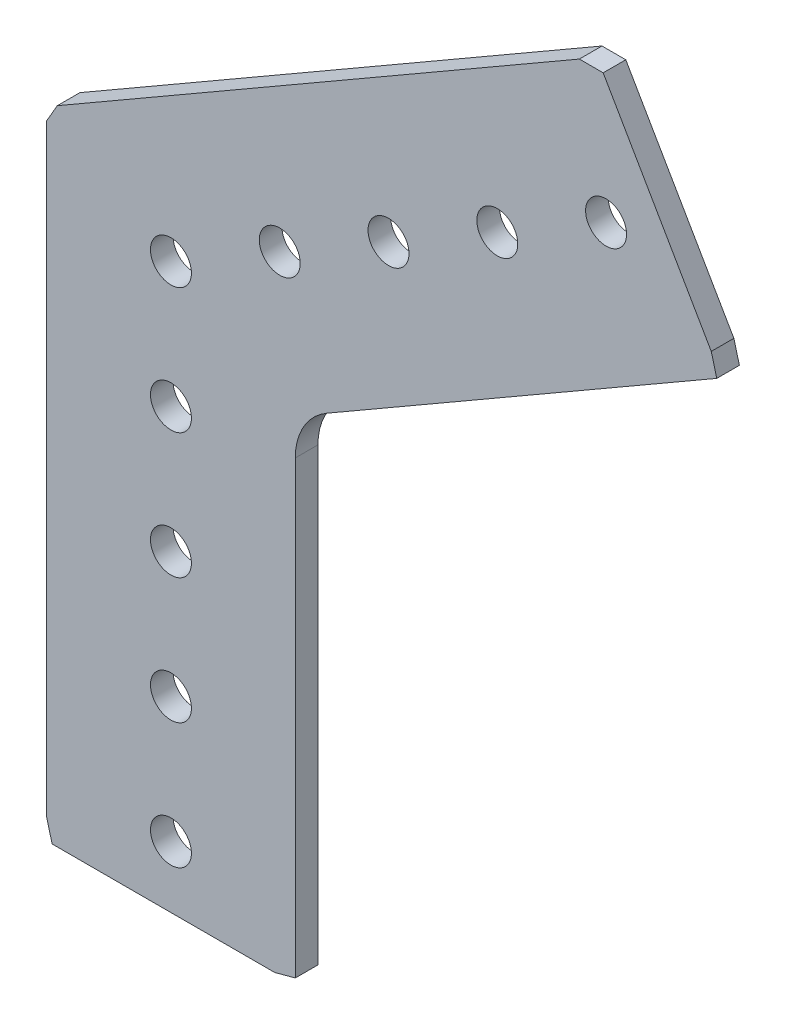
ISO-10303-21;
HEADER;
FILE_DESCRIPTION(('STEP AP214'),'2;1');
FILE_NAME('part.step','',(''),(''),'','','');
FILE_SCHEMA(('AUTOMOTIVE_DESIGN { 1 0 10303 214 1 1 1 1 }'));
ENDSEC;
DATA;
#1=APPLICATION_CONTEXT('core data for automotive mechanical design processes');
#2=APPLICATION_PROTOCOL_DEFINITION('international standard','automotive_design',2000,#1);
#3=PRODUCT_CONTEXT('',#1,'mechanical');
#4=PRODUCT('Part','Part','',(#3));
#5=PRODUCT_RELATED_PRODUCT_CATEGORY('part','',(#4));
#6=PRODUCT_DEFINITION_FORMATION('','',#4);
#7=PRODUCT_DEFINITION_CONTEXT('part definition',#1,'design');
#8=PRODUCT_DEFINITION('design','',#6,#7);
#9=PRODUCT_DEFINITION_SHAPE('','',#8);
#10=(LENGTH_UNIT() NAMED_UNIT(*) SI_UNIT(.MILLI.,.METRE.));
#11=(NAMED_UNIT(*) PLANE_ANGLE_UNIT() SI_UNIT($,.RADIAN.));
#12=(NAMED_UNIT(*) SI_UNIT($,.STERADIAN.) SOLID_ANGLE_UNIT());
#13=UNCERTAINTY_MEASURE_WITH_UNIT(LENGTH_MEASURE(1.E-05),#10,'distance_accuracy_value','');
#14=(GEOMETRIC_REPRESENTATION_CONTEXT(3) GLOBAL_UNCERTAINTY_ASSIGNED_CONTEXT((#13)) GLOBAL_UNIT_ASSIGNED_CONTEXT((#10,
#11,#12)) REPRESENTATION_CONTEXT('',''));
#15=CARTESIAN_POINT('',(0.,0.,0.));
#16=DIRECTION('',(0.,0.,1.));
#17=DIRECTION('',(1.,0.,0.));
#18=AXIS2_PLACEMENT_3D('',#15,#16,#17);
#19=CARTESIAN_POINT('',(43.6988794999231,38.357320472303,0.));
#20=DIRECTION('',(0.,1.,0.));
#21=DIRECTION('',(0.,0.,1.));
#22=AXIS2_PLACEMENT_3D('',#19,#20,#21);
#23=PLANE('',#22);
#24=DIRECTION('',(-1.,0.,0.));
#25=VECTOR('',#24,1.);
#26=CARTESIAN_POINT('',(43.6988794999231,38.357320472303,2.286));
#27=LINE('',#26,#25);
#28=CARTESIAN_POINT('',(43.6988794999231,38.357320472303,2.286));
#29=VERTEX_POINT('',#28);
#30=CARTESIAN_POINT('',(41.2908279002298,38.357320472303,2.286));
#31=VERTEX_POINT('',#30);
#32=EDGE_CURVE('E156',#29,#31,#27,.T.);
#33=ORIENTED_EDGE('',*,*,#32,.F.);
#34=DIRECTION('',(0.,0.,1.));
#35=VECTOR('',#34,1.);
#36=CARTESIAN_POINT('',(43.6988794999231,38.357320472303,0.));
#37=LINE('',#36,#35);
#38=CARTESIAN_POINT('',(43.6988794999231,38.357320472303,0.));
#39=VERTEX_POINT('',#38);
#40=EDGE_CURVE('E11',#39,#29,#37,.T.);
#41=ORIENTED_EDGE('',*,*,#40,.F.);
#42=DIRECTION('',(-1.,0.,0.));
#43=VECTOR('',#42,1.);
#44=CARTESIAN_POINT('',(43.6988794999231,38.357320472303,0.));
#45=LINE('',#44,#43);
#46=CARTESIAN_POINT('',(41.2908279002298,38.357320472303,0.));
#47=VERTEX_POINT('',#46);
#48=EDGE_CURVE('E189',#39,#47,#45,.T.);
#49=ORIENTED_EDGE('',*,*,#48,.T.);
#50=DIRECTION('',(0.,0.,1.));
#51=VECTOR('',#50,1.);
#52=CARTESIAN_POINT('',(41.2908279002298,38.357320472303,0.));
#53=LINE('',#52,#51);
#54=EDGE_CURVE('E38',#47,#31,#53,.T.);
#55=ORIENTED_EDGE('',*,*,#54,.T.);
#56=EDGE_LOOP('',(#33,#41,#49,#55));
#57=FACE_BOUND('',#56,.T.);
#58=ADVANCED_FACE('F35',(#57),#23,.T.);
#59=CARTESIAN_POINT('',(54.6271496705208,19.4290012979886,0.));
#60=DIRECTION('',(0.866025403784435,0.500000000000007,0.));
#61=DIRECTION('',(-0.500000000000007,0.866025403784435,0.));
#62=AXIS2_PLACEMENT_3D('',#59,#60,#61);
#63=PLANE('',#62);
#64=DIRECTION('',(-0.500000000000007,0.866025403784435,0.));
#65=VECTOR('',#64,1.);
#66=CARTESIAN_POINT('',(54.6271496705208,19.4290012979886,2.286));
#67=LINE('',#66,#65);
#68=CARTESIAN_POINT('',(54.6271496705208,19.4290012979886,2.286));
#69=VERTEX_POINT('',#68);
#70=EDGE_CURVE('E187',#69,#29,#67,.T.);
#71=ORIENTED_EDGE('',*,*,#70,.F.);
#72=DIRECTION('',(0.,0.,1.));
#73=VECTOR('',#72,1.);
#74=CARTESIAN_POINT('',(54.6271496705208,19.4290012979886,0.));
#75=LINE('',#74,#73);
#76=CARTESIAN_POINT('',(54.6271496705208,19.4290012979886,0.));
#77=VERTEX_POINT('',#76);
#78=EDGE_CURVE('E44',#77,#69,#75,.T.);
#79=ORIENTED_EDGE('',*,*,#78,.F.);
#80=DIRECTION('',(-0.500000000000007,0.866025403784435,0.));
#81=VECTOR('',#80,1.);
#82=CARTESIAN_POINT('',(54.6271496705208,19.4290012979886,0.));
#83=LINE('',#82,#81);
#84=EDGE_CURVE('E146',#77,#39,#83,.T.);
#85=ORIENTED_EDGE('',*,*,#84,.T.);
#86=ORIENTED_EDGE('',*,*,#40,.T.);
#87=EDGE_LOOP('',(#71,#79,#85,#86));
#88=FACE_BOUND('',#87,.T.);
#89=ADVANCED_FACE('F209',(#88),#63,.T.);
#90=CARTESIAN_POINT('',(55.1859399888972,17.3435674390305,0.));
#91=DIRECTION('',(0.965925826289063,0.258819045102542,0.));
#92=DIRECTION('',(-0.258819045102542,0.965925826289063,0.));
#93=AXIS2_PLACEMENT_3D('',#90,#91,#92);
#94=PLANE('',#93);
#95=DIRECTION('',(-0.258819045102542,0.965925826289063,0.));
#96=VECTOR('',#95,1.);
#97=CARTESIAN_POINT('',(55.1859399888972,17.3435674390305,2.286));
#98=LINE('',#97,#96);
#99=CARTESIAN_POINT('',(55.1859399888972,17.3435674390305,2.286));
#100=VERTEX_POINT('',#99);
#101=EDGE_CURVE('E133',#100,#69,#98,.T.);
#102=ORIENTED_EDGE('',*,*,#101,.F.);
#103=DIRECTION('',(0.,0.,1.));
#104=VECTOR('',#103,1.);
#105=CARTESIAN_POINT('',(55.1859399888972,17.3435674390305,0.));
#106=LINE('',#105,#104);
#107=CARTESIAN_POINT('',(55.1859399888972,17.3435674390305,0.));
#108=VERTEX_POINT('',#107);
#109=EDGE_CURVE('E128',#108,#100,#106,.T.);
#110=ORIENTED_EDGE('',*,*,#109,.F.);
#111=DIRECTION('',(-0.258819045102542,0.965925826289063,0.));
#112=VECTOR('',#111,1.);
#113=CARTESIAN_POINT('',(55.1859399888972,17.3435674390305,0.));
#114=LINE('',#113,#112);
#115=EDGE_CURVE('E131',#108,#77,#114,.T.);
#116=ORIENTED_EDGE('',*,*,#115,.T.);
#117=ORIENTED_EDGE('',*,*,#78,.T.);
#118=EDGE_LOOP('',(#102,#110,#116,#117));
#119=FACE_BOUND('',#118,.T.);
#120=ADVANCED_FACE('F130',(#119),#94,.T.);
#121=CARTESIAN_POINT('',(15.7479999999999,-5.42593782984402,0.));
#122=DIRECTION('',(0.500000000000006,-0.866025403784435,0.));
#123=DIRECTION('',(0.866025403784435,0.500000000000006,0.));
#124=AXIS2_PLACEMENT_3D('',#121,#122,#123);
#125=PLANE('',#124);
#126=DIRECTION('',(0.866025403784435,0.500000000000006,0.));
#127=VECTOR('',#126,1.);
#128=CARTESIAN_POINT('',(15.7479999999999,-5.42593782984402,2.286));
#129=LINE('',#128,#127);
#130=CARTESIAN_POINT('',(15.7479999999999,-5.42593782984402,2.286));
#131=VERTEX_POINT('',#130);
#132=EDGE_CURVE('E184',#131,#100,#129,.T.);
#133=ORIENTED_EDGE('',*,*,#132,.F.);
#134=DIRECTION('',(0.,0.,1.));
#135=VECTOR('',#134,1.);
#136=CARTESIAN_POINT('',(15.7479999999999,-5.42593782984402,0.));
#137=LINE('',#136,#135);
#138=CARTESIAN_POINT('',(15.7479999999999,-5.42593782984402,0.));
#139=VERTEX_POINT('',#138);
#140=EDGE_CURVE('E138',#139,#131,#137,.T.);
#141=ORIENTED_EDGE('',*,*,#140,.F.);
#142=DIRECTION('',(0.866025403784435,0.500000000000006,0.));
#143=VECTOR('',#142,1.);
#144=CARTESIAN_POINT('',(15.7479999999999,-5.42593782984402,0.));
#145=LINE('',#144,#143);
#146=EDGE_CURVE('E144',#139,#108,#145,.T.);
#147=ORIENTED_EDGE('',*,*,#146,.T.);
#148=ORIENTED_EDGE('',*,*,#109,.T.);
#149=EDGE_LOOP('',(#133,#141,#147,#148));
#150=FACE_BOUND('',#149,.T.);
#151=ADVANCED_FACE('F148',(#150),#125,.T.);
#152=CARTESIAN_POINT('',(18.923,-10.9251991438752,0.));
#153=DIRECTION('',(0.,0.,1.));
#154=DIRECTION('',(1.,0.,0.));
#155=AXIS2_PLACEMENT_3D('',#152,#153,#154);
#156=CYLINDRICAL_SURFACE('',#155,6.35);
#157=CARTESIAN_POINT('',(18.923,-10.9251991438752,2.286));
#158=DIRECTION('',(0.,0.,-1.));
#159=DIRECTION('',(-1.,0.,0.));
#160=AXIS2_PLACEMENT_3D('',#157,#158,#159);
#161=CIRCLE('',#160,6.35);
#162=CARTESIAN_POINT('',(12.573,-10.9251991438752,2.286));
#163=VERTEX_POINT('',#162);
#164=EDGE_CURVE('E181',#163,#131,#161,.T.);
#165=ORIENTED_EDGE('',*,*,#164,.F.);
#166=DIRECTION('',(0.,0.,1.));
#167=VECTOR('',#166,1.);
#168=CARTESIAN_POINT('',(12.573,-10.9251991438752,0.));
#169=LINE('',#168,#167);
#170=CARTESIAN_POINT('',(12.573,-10.9251991438752,0.));
#171=VERTEX_POINT('',#170);
#172=EDGE_CURVE('E193',#171,#163,#169,.T.);
#173=ORIENTED_EDGE('',*,*,#172,.F.);
#174=CARTESIAN_POINT('',(18.923,-10.9251991438752,0.));
#175=DIRECTION('',(0.,0.,-1.));
#176=DIRECTION('',(-1.,0.,0.));
#177=AXIS2_PLACEMENT_3D('',#174,#175,#176);
#178=CIRCLE('',#177,6.35);
#179=EDGE_CURVE('E149',#171,#139,#178,.T.);
#180=ORIENTED_EDGE('',*,*,#179,.T.);
#181=ORIENTED_EDGE('',*,*,#140,.T.);
#182=EDGE_LOOP('',(#165,#173,#180,#181));
#183=FACE_BOUND('',#182,.T.);
#184=ADVANCED_FACE('F222',(#183),#156,.F.);
#185=CARTESIAN_POINT('',(12.573,-56.4642096816237,0.));
#186=DIRECTION('',(1.,0.,0.));
#187=DIRECTION('',(0.,0.,-1.));
#188=AXIS2_PLACEMENT_3D('',#185,#186,#187);
#189=PLANE('',#188);
#190=DIRECTION('',(0.,1.,0.));
#191=VECTOR('',#190,1.);
#192=CARTESIAN_POINT('',(12.573,-56.4642096816237,2.286));
#193=LINE('',#192,#191);
#194=CARTESIAN_POINT('',(12.573,-56.4642096816237,2.286));
#195=VERTEX_POINT('',#194);
#196=EDGE_CURVE('E178',#195,#163,#193,.T.);
#197=ORIENTED_EDGE('',*,*,#196,.F.);
#198=DIRECTION('',(0.,0.,1.));
#199=VECTOR('',#198,1.);
#200=CARTESIAN_POINT('',(12.573,-56.4642096816237,0.));
#201=LINE('',#200,#199);
#202=CARTESIAN_POINT('',(12.573,-56.4642096816237,0.));
#203=VERTEX_POINT('',#202);
#204=EDGE_CURVE('E195',#203,#195,#201,.T.);
#205=ORIENTED_EDGE('',*,*,#204,.F.);
#206=DIRECTION('',(0.,1.,0.));
#207=VECTOR('',#206,1.);
#208=CARTESIAN_POINT('',(12.573,-56.4642096816237,0.));
#209=LINE('',#208,#207);
#210=EDGE_CURVE('E151',#203,#171,#209,.T.);
#211=ORIENTED_EDGE('',*,*,#210,.T.);
#212=ORIENTED_EDGE('',*,*,#172,.T.);
#213=EDGE_LOOP('',(#197,#205,#211,#212));
#214=FACE_BOUND('',#213,.T.);
#215=ADVANCED_FACE('F225',(#214),#189,.T.);
#216=CARTESIAN_POINT('',(10.4875661410419,-57.023,0.));
#217=DIRECTION('',(0.258819045102521,-0.965925826289068,0.));
#218=DIRECTION('',(0.965925826289068,0.258819045102521,0.));
#219=AXIS2_PLACEMENT_3D('',#216,#217,#218);
#220=PLANE('',#219);
#221=DIRECTION('',(0.965925826289068,0.258819045102521,0.));
#222=VECTOR('',#221,1.);
#223=CARTESIAN_POINT('',(10.4875661410419,-57.023,2.286));
#224=LINE('',#223,#222);
#225=CARTESIAN_POINT('',(10.4875661410419,-57.023,2.286));
#226=VERTEX_POINT('',#225);
#227=EDGE_CURVE('E175',#226,#195,#224,.T.);
#228=ORIENTED_EDGE('',*,*,#227,.F.);
#229=DIRECTION('',(0.,0.,1.));
#230=VECTOR('',#229,1.);
#231=CARTESIAN_POINT('',(10.4875661410419,-57.023,0.));
#232=LINE('',#231,#230);
#233=CARTESIAN_POINT('',(10.4875661410419,-57.023,0.));
#234=VERTEX_POINT('',#233);
#235=EDGE_CURVE('E197',#234,#226,#232,.T.);
#236=ORIENTED_EDGE('',*,*,#235,.F.);
#237=DIRECTION('',(0.965925826289068,0.258819045102521,0.));
#238=VECTOR('',#237,1.);
#239=CARTESIAN_POINT('',(10.4875661410419,-57.023,0.));
#240=LINE('',#239,#238);
#241=EDGE_CURVE('E369',#234,#203,#240,.T.);
#242=ORIENTED_EDGE('',*,*,#241,.T.);
#243=ORIENTED_EDGE('',*,*,#204,.T.);
#244=EDGE_LOOP('',(#228,#236,#242,#243));
#245=FACE_BOUND('',#244,.T.);
#246=ADVANCED_FACE('F229',(#245),#220,.T.);
#247=CARTESIAN_POINT('',(-12.0142096816237,-57.023,0.));
#248=DIRECTION('',(0.,-1.,0.));
#249=DIRECTION('',(0.,0.,-1.));
#250=AXIS2_PLACEMENT_3D('',#247,#248,#249);
#251=PLANE('',#250);
#252=DIRECTION('',(1.,0.,0.));
#253=VECTOR('',#252,1.);
#254=CARTESIAN_POINT('',(-12.0142096816237,-57.023,2.286));
#255=LINE('',#254,#253);
#256=CARTESIAN_POINT('',(-12.0142096816237,-57.023,2.286));
#257=VERTEX_POINT('',#256);
#258=EDGE_CURVE('E172',#257,#226,#255,.T.);
#259=ORIENTED_EDGE('',*,*,#258,.F.);
#260=DIRECTION('',(0.,0.,1.));
#261=VECTOR('',#260,1.);
#262=CARTESIAN_POINT('',(-12.0142096816237,-57.023,0.));
#263=LINE('',#262,#261);
#264=CARTESIAN_POINT('',(-12.0142096816237,-57.023,0.));
#265=VERTEX_POINT('',#264);
#266=EDGE_CURVE('E199',#265,#257,#263,.T.);
#267=ORIENTED_EDGE('',*,*,#266,.F.);
#268=DIRECTION('',(1.,0.,0.));
#269=VECTOR('',#268,1.);
#270=CARTESIAN_POINT('',(-12.0142096816237,-57.023,0.));
#271=LINE('',#270,#269);
#272=EDGE_CURVE('E366',#265,#234,#271,.T.);
#273=ORIENTED_EDGE('',*,*,#272,.T.);
#274=ORIENTED_EDGE('',*,*,#235,.T.);
#275=EDGE_LOOP('',(#259,#267,#273,#274));
#276=FACE_BOUND('',#275,.T.);
#277=ADVANCED_FACE('F233',(#276),#251,.T.);
#278=CARTESIAN_POINT('',(-12.573,-54.9375661410419,0.));
#279=DIRECTION('',(-0.965925826289068,-0.258819045102523,0.));
#280=DIRECTION('',(0.258819045102523,-0.965925826289068,0.));
#281=AXIS2_PLACEMENT_3D('',#278,#279,#280);
#282=PLANE('',#281);
#283=DIRECTION('',(0.258819045102523,-0.965925826289068,0.));
#284=VECTOR('',#283,1.);
#285=CARTESIAN_POINT('',(-12.573,-54.9375661410419,2.286));
#286=LINE('',#285,#284);
#287=CARTESIAN_POINT('',(-12.573,-54.9375661410419,2.286));
#288=VERTEX_POINT('',#287);
#289=EDGE_CURVE('E169',#288,#257,#286,.T.);
#290=ORIENTED_EDGE('',*,*,#289,.F.);
#291=DIRECTION('',(0.,0.,1.));
#292=VECTOR('',#291,1.);
#293=CARTESIAN_POINT('',(-12.573,-54.9375661410419,0.));
#294=LINE('',#293,#292);
#295=CARTESIAN_POINT('',(-12.573,-54.9375661410419,0.));
#296=VERTEX_POINT('',#295);
#297=EDGE_CURVE('E201',#296,#288,#294,.T.);
#298=ORIENTED_EDGE('',*,*,#297,.F.);
#299=DIRECTION('',(0.258819045102523,-0.965925826289068,0.));
#300=VECTOR('',#299,1.);
#301=CARTESIAN_POINT('',(-12.573,-54.9375661410419,0.));
#302=LINE('',#301,#300);
#303=EDGE_CURVE('E363',#296,#265,#302,.T.);
#304=ORIENTED_EDGE('',*,*,#303,.T.);
#305=ORIENTED_EDGE('',*,*,#266,.T.);
#306=EDGE_LOOP('',(#290,#298,#304,#305));
#307=FACE_BOUND('',#306,.T.);
#308=ADVANCED_FACE('F237',(#307),#282,.T.);
#309=CARTESIAN_POINT('',(-12.573,6.01252570334088,0.));
#310=DIRECTION('',(-1.,0.,0.));
#311=DIRECTION('',(0.,0.,1.));
#312=AXIS2_PLACEMENT_3D('',#309,#310,#311);
#313=PLANE('',#312);
#314=DIRECTION('',(0.,-1.,0.));
#315=VECTOR('',#314,1.);
#316=CARTESIAN_POINT('',(-12.573,6.01252570334088,2.286));
#317=LINE('',#316,#315);
#318=CARTESIAN_POINT('',(-12.573,6.01252570334088,2.286));
#319=VERTEX_POINT('',#318);
#320=EDGE_CURVE('E166',#319,#288,#317,.T.);
#321=ORIENTED_EDGE('',*,*,#320,.F.);
#322=DIRECTION('',(0.,0.,1.));
#323=VECTOR('',#322,1.);
#324=CARTESIAN_POINT('',(-12.573,6.01252570334088,0.));
#325=LINE('',#324,#323);
#326=CARTESIAN_POINT('',(-12.573,6.01252570334088,0.));
#327=VERTEX_POINT('',#326);
#328=EDGE_CURVE('E203',#327,#319,#325,.T.);
#329=ORIENTED_EDGE('',*,*,#328,.F.);
#330=DIRECTION('',(0.,-1.,0.));
#331=VECTOR('',#330,1.);
#332=CARTESIAN_POINT('',(-12.573,6.01252570334088,0.));
#333=LINE('',#332,#331);
#334=EDGE_CURVE('E360',#327,#296,#333,.T.);
#335=ORIENTED_EDGE('',*,*,#334,.T.);
#336=ORIENTED_EDGE('',*,*,#297,.T.);
#337=EDGE_LOOP('',(#321,#329,#335,#336));
#338=FACE_BOUND('',#337,.T.);
#339=ADVANCED_FACE('F241',(#338),#313,.T.);
#340=CARTESIAN_POINT('',(-11.4935000000001,7.88227455011127,0.));
#341=DIRECTION('',(-0.866025403784439,0.5,0.));
#342=DIRECTION('',(-0.5,-0.866025403784439,0.));
#343=AXIS2_PLACEMENT_3D('',#340,#341,#342);
#344=PLANE('',#343);
#345=DIRECTION('',(-0.5,-0.866025403784439,0.));
#346=VECTOR('',#345,1.);
#347=CARTESIAN_POINT('',(-11.4935000000001,7.88227455011127,2.286));
#348=LINE('',#347,#346);
#349=CARTESIAN_POINT('',(-11.4935000000001,7.88227455011127,2.286));
#350=VERTEX_POINT('',#349);
#351=EDGE_CURVE('E163',#350,#319,#348,.T.);
#352=ORIENTED_EDGE('',*,*,#351,.F.);
#353=DIRECTION('',(0.,0.,1.));
#354=VECTOR('',#353,1.);
#355=CARTESIAN_POINT('',(-11.4935000000001,7.88227455011127,0.));
#356=LINE('',#355,#354);
#357=CARTESIAN_POINT('',(-11.4935000000001,7.88227455011127,0.));
#358=VERTEX_POINT('',#357);
#359=EDGE_CURVE('E204',#358,#350,#356,.T.);
#360=ORIENTED_EDGE('',*,*,#359,.F.);
#361=DIRECTION('',(-0.5,-0.866025403784439,0.));
#362=VECTOR('',#361,1.);
#363=CARTESIAN_POINT('',(-11.4935000000001,7.88227455011127,0.));
#364=LINE('',#363,#362);
#365=EDGE_CURVE('E357',#358,#327,#364,.T.);
#366=ORIENTED_EDGE('',*,*,#365,.T.);
#367=ORIENTED_EDGE('',*,*,#328,.T.);
#368=EDGE_LOOP('',(#352,#360,#366,#367));
#369=FACE_BOUND('',#368,.T.);
#370=ADVANCED_FACE('F245',(#369),#344,.T.);
#371=CARTESIAN_POINT('',(41.2908279002298,38.357320472303,0.));
#372=DIRECTION('',(-0.500000000000007,0.866025403784435,0.));
#373=DIRECTION('',(-0.866025403784435,-0.500000000000007,0.));
#374=AXIS2_PLACEMENT_3D('',#371,#372,#373);
#375=PLANE('',#374);
#376=DIRECTION('',(-0.866025403784435,-0.500000000000007,0.));
#377=VECTOR('',#376,1.);
#378=CARTESIAN_POINT('',(41.2908279002298,38.357320472303,2.286));
#379=LINE('',#378,#377);
#380=EDGE_CURVE('E159',#31,#350,#379,.T.);
#381=ORIENTED_EDGE('',*,*,#380,.F.);
#382=ORIENTED_EDGE('',*,*,#54,.F.);
#383=DIRECTION('',(-0.866025403784435,-0.500000000000007,0.));
#384=VECTOR('',#383,1.);
#385=CARTESIAN_POINT('',(41.2908279002298,38.357320472303,0.));
#386=LINE('',#385,#384);
#387=EDGE_CURVE('E355',#47,#358,#386,.T.);
#388=ORIENTED_EDGE('',*,*,#387,.T.);
#389=ORIENTED_EDGE('',*,*,#359,.T.);
#390=EDGE_LOOP('',(#381,#382,#388,#389));
#391=FACE_BOUND('',#390,.T.);
#392=ADVANCED_FACE('F206',(#391),#375,.T.);
#393=CARTESIAN_POINT('',(18.923,-10.9251991438752,0.));
#394=DIRECTION('',(0.,0.,-1.));
#395=DIRECTION('',(-1.,0.,0.));
#396=AXIS2_PLACEMENT_3D('',#393,#394,#395);
#397=PLANE('',#396);
#398=CARTESIAN_POINT('',(43.9940905122493,25.4000000000003,0.));
#399=DIRECTION('',(0.,0.,1.));
#400=DIRECTION('',(-1.,0.,0.));
#401=AXIS2_PLACEMENT_3D('',#398,#399,#400);
#402=CIRCLE('',#401,2.0701);
#403=CARTESIAN_POINT('',(41.9239905122493,25.4000000000003,0.));
#404=VERTEX_POINT('',#403);
#405=EDGE_CURVE('E300',#404,#404,#402,.T.);
#406=ORIENTED_EDGE('',*,*,#405,.T.);
#407=EDGE_LOOP('',(#406));
#408=FACE_BOUND('',#407,.T.);
#409=CARTESIAN_POINT('',(21.9970452561248,12.6999999999999,0.));
#410=DIRECTION('',(0.,0.,1.));
#411=DIRECTION('',(-1.,0.,0.));
#412=AXIS2_PLACEMENT_3D('',#409,#410,#411);
#413=CIRCLE('',#412,2.0701);
#414=CARTESIAN_POINT('',(19.9269452561248,12.6999999999999,0.));
#415=VERTEX_POINT('',#414);
#416=EDGE_CURVE('E308',#415,#415,#413,.T.);
#417=ORIENTED_EDGE('',*,*,#416,.T.);
#418=EDGE_LOOP('',(#417));
#419=FACE_BOUND('',#418,.T.);
#420=CARTESIAN_POINT('',(10.9985226280624,6.34999999999997,0.));
#421=DIRECTION('',(0.,0.,1.));
#422=DIRECTION('',(-1.,0.,0.));
#423=AXIS2_PLACEMENT_3D('',#420,#421,#422);
#424=CIRCLE('',#423,2.0701);
#425=CARTESIAN_POINT('',(8.92842262806239,6.34999999999997,0.));
#426=VERTEX_POINT('',#425);
#427=EDGE_CURVE('E314',#426,#426,#424,.T.);
#428=ORIENTED_EDGE('',*,*,#427,.T.);
#429=EDGE_LOOP('',(#428));
#430=FACE_BOUND('',#429,.T.);
#431=CARTESIAN_POINT('',(32.9955678841872,19.0499999999999,0.));
#432=DIRECTION('',(0.,0.,1.));
#433=DIRECTION('',(-1.,0.,0.));
#434=AXIS2_PLACEMENT_3D('',#431,#432,#433);
#435=CIRCLE('',#434,2.0701);
#436=CARTESIAN_POINT('',(30.9254678841872,19.0499999999999,0.));
#437=VERTEX_POINT('',#436);
#438=EDGE_CURVE('E320',#437,#437,#435,.T.);
#439=ORIENTED_EDGE('',*,*,#438,.T.);
#440=EDGE_LOOP('',(#439));
#441=FACE_BOUND('',#440,.T.);
#442=CARTESIAN_POINT('',(0.,-50.8,0.));
#443=DIRECTION('',(0.,0.,1.));
#444=DIRECTION('',(-1.,0.,0.));
#445=AXIS2_PLACEMENT_3D('',#442,#443,#444);
#446=CIRCLE('',#445,2.0701);
#447=CARTESIAN_POINT('',(-2.07009999999999,-50.8,0.));
#448=VERTEX_POINT('',#447);
#449=EDGE_CURVE('E326',#448,#448,#446,.T.);
#450=ORIENTED_EDGE('',*,*,#449,.T.);
#451=EDGE_LOOP('',(#450));
#452=FACE_BOUND('',#451,.T.);
#453=CARTESIAN_POINT('',(2.66050878019847E-13,-25.4,0.));
#454=DIRECTION('',(0.,0.,1.));
#455=DIRECTION('',(-1.,0.,0.));
#456=AXIS2_PLACEMENT_3D('',#453,#454,#455);
#457=CIRCLE('',#456,2.0701);
#458=CARTESIAN_POINT('',(-2.07009999999973,-25.4,0.));
#459=VERTEX_POINT('',#458);
#460=EDGE_CURVE('E332',#459,#459,#457,.T.);
#461=ORIENTED_EDGE('',*,*,#460,.T.);
#462=EDGE_LOOP('',(#461));
#463=FACE_BOUND('',#462,.T.);
#464=CARTESIAN_POINT('',(1.33025439009923E-13,-12.7,0.));
#465=DIRECTION('',(0.,0.,1.));
#466=DIRECTION('',(-1.,0.,0.));
#467=AXIS2_PLACEMENT_3D('',#464,#465,#466);
#468=CIRCLE('',#467,2.0701);
#469=CARTESIAN_POINT('',(-2.07009999999987,-12.7,0.));
#470=VERTEX_POINT('',#469);
#471=EDGE_CURVE('E338',#470,#470,#468,.T.);
#472=ORIENTED_EDGE('',*,*,#471,.T.);
#473=EDGE_LOOP('',(#472));
#474=FACE_BOUND('',#473,.T.);
#475=CARTESIAN_POINT('',(3.9907631702977E-13,-38.1,0.));
#476=DIRECTION('',(0.,0.,1.));
#477=DIRECTION('',(-1.,0.,0.));
#478=AXIS2_PLACEMENT_3D('',#475,#476,#477);
#479=CIRCLE('',#478,2.0701);
#480=CARTESIAN_POINT('',(-2.0700999999996,-38.1,0.));
#481=VERTEX_POINT('',#480);
#482=EDGE_CURVE('E344',#481,#481,#479,.T.);
#483=ORIENTED_EDGE('',*,*,#482,.T.);
#484=EDGE_LOOP('',(#483));
#485=FACE_BOUND('',#484,.T.);
#486=CARTESIAN_POINT('',(0.,0.,0.));
#487=DIRECTION('',(0.,0.,1.));
#488=DIRECTION('',(-1.,0.,0.));
#489=AXIS2_PLACEMENT_3D('',#486,#487,#488);
#490=CIRCLE('',#489,2.0701);
#491=CARTESIAN_POINT('',(-2.0701,0.,0.));
#492=VERTEX_POINT('',#491);
#493=EDGE_CURVE('E160',#492,#492,#490,.T.);
#494=ORIENTED_EDGE('',*,*,#493,.T.);
#495=EDGE_LOOP('',(#494));
#496=FACE_BOUND('',#495,.T.);
#497=ORIENTED_EDGE('',*,*,#48,.F.);
#498=ORIENTED_EDGE('',*,*,#84,.F.);
#499=ORIENTED_EDGE('',*,*,#115,.F.);
#500=ORIENTED_EDGE('',*,*,#146,.F.);
#501=ORIENTED_EDGE('',*,*,#179,.F.);
#502=ORIENTED_EDGE('',*,*,#210,.F.);
#503=ORIENTED_EDGE('',*,*,#241,.F.);
#504=ORIENTED_EDGE('',*,*,#272,.F.);
#505=ORIENTED_EDGE('',*,*,#303,.F.);
#506=ORIENTED_EDGE('',*,*,#334,.F.);
#507=ORIENTED_EDGE('',*,*,#365,.F.);
#508=ORIENTED_EDGE('',*,*,#387,.F.);
#509=EDGE_LOOP('',(#497,#498,#499,#500,#501,#502,#503,#504,#505,#506,#507,#508));
#510=FACE_BOUND('',#509,.T.);
#511=ADVANCED_FACE('F142',(#408,#419,#430,#441,#452,#463,#474,#485,#496,#510),#397,.T.);
#512=CARTESIAN_POINT('',(18.923,-10.9251991438752,2.286));
#513=DIRECTION('',(0.,0.,-1.));
#514=DIRECTION('',(-1.,0.,0.));
#515=AXIS2_PLACEMENT_3D('',#512,#513,#514);
#516=PLANE('',#515);
#517=CARTESIAN_POINT('',(43.9940905122493,25.4000000000003,2.286));
#518=DIRECTION('',(0.,0.,1.));
#519=DIRECTION('',(-1.,0.,0.));
#520=AXIS2_PLACEMENT_3D('',#517,#518,#519);
#521=CIRCLE('',#520,2.0701);
#522=CARTESIAN_POINT('',(41.9239905122493,25.4000000000003,2.286));
#523=VERTEX_POINT('',#522);
#524=EDGE_CURVE('E303',#523,#523,#521,.T.);
#525=ORIENTED_EDGE('',*,*,#524,.F.);
#526=EDGE_LOOP('',(#525));
#527=FACE_BOUND('',#526,.T.);
#528=CARTESIAN_POINT('',(21.9970452561248,12.6999999999999,2.286));
#529=DIRECTION('',(0.,0.,1.));
#530=DIRECTION('',(-1.,0.,0.));
#531=AXIS2_PLACEMENT_3D('',#528,#529,#530);
#532=CIRCLE('',#531,2.0701);
#533=CARTESIAN_POINT('',(19.9269452561248,12.6999999999999,2.286));
#534=VERTEX_POINT('',#533);
#535=EDGE_CURVE('E305',#534,#534,#532,.T.);
#536=ORIENTED_EDGE('',*,*,#535,.F.);
#537=EDGE_LOOP('',(#536));
#538=FACE_BOUND('',#537,.T.);
#539=CARTESIAN_POINT('',(10.9985226280624,6.34999999999997,2.286));
#540=DIRECTION('',(0.,0.,1.));
#541=DIRECTION('',(-1.,0.,0.));
#542=AXIS2_PLACEMENT_3D('',#539,#540,#541);
#543=CIRCLE('',#542,2.0701);
#544=CARTESIAN_POINT('',(8.92842262806239,6.34999999999997,2.286));
#545=VERTEX_POINT('',#544);
#546=EDGE_CURVE('E311',#545,#545,#543,.T.);
#547=ORIENTED_EDGE('',*,*,#546,.F.);
#548=EDGE_LOOP('',(#547));
#549=FACE_BOUND('',#548,.T.);
#550=CARTESIAN_POINT('',(32.9955678841872,19.0499999999999,2.286));
#551=DIRECTION('',(0.,0.,1.));
#552=DIRECTION('',(-1.,0.,0.));
#553=AXIS2_PLACEMENT_3D('',#550,#551,#552);
#554=CIRCLE('',#553,2.0701);
#555=CARTESIAN_POINT('',(30.9254678841872,19.0499999999999,2.286));
#556=VERTEX_POINT('',#555);
#557=EDGE_CURVE('E317',#556,#556,#554,.T.);
#558=ORIENTED_EDGE('',*,*,#557,.F.);
#559=EDGE_LOOP('',(#558));
#560=FACE_BOUND('',#559,.T.);
#561=CARTESIAN_POINT('',(0.,-50.8,2.286));
#562=DIRECTION('',(0.,0.,1.));
#563=DIRECTION('',(-1.,0.,0.));
#564=AXIS2_PLACEMENT_3D('',#561,#562,#563);
#565=CIRCLE('',#564,2.0701);
#566=CARTESIAN_POINT('',(-2.07009999999999,-50.8,2.286));
#567=VERTEX_POINT('',#566);
#568=EDGE_CURVE('E323',#567,#567,#565,.T.);
#569=ORIENTED_EDGE('',*,*,#568,.F.);
#570=EDGE_LOOP('',(#569));
#571=FACE_BOUND('',#570,.T.);
#572=CARTESIAN_POINT('',(2.66050878019847E-13,-25.4,2.286));
#573=DIRECTION('',(0.,0.,1.));
#574=DIRECTION('',(-1.,0.,0.));
#575=AXIS2_PLACEMENT_3D('',#572,#573,#574);
#576=CIRCLE('',#575,2.0701);
#577=CARTESIAN_POINT('',(-2.07009999999973,-25.4,2.286));
#578=VERTEX_POINT('',#577);
#579=EDGE_CURVE('E329',#578,#578,#576,.T.);
#580=ORIENTED_EDGE('',*,*,#579,.F.);
#581=EDGE_LOOP('',(#580));
#582=FACE_BOUND('',#581,.T.);
#583=CARTESIAN_POINT('',(1.33025439009923E-13,-12.7,2.286));
#584=DIRECTION('',(0.,0.,1.));
#585=DIRECTION('',(-1.,0.,0.));
#586=AXIS2_PLACEMENT_3D('',#583,#584,#585);
#587=CIRCLE('',#586,2.0701);
#588=CARTESIAN_POINT('',(-2.07009999999987,-12.7,2.286));
#589=VERTEX_POINT('',#588);
#590=EDGE_CURVE('E335',#589,#589,#587,.T.);
#591=ORIENTED_EDGE('',*,*,#590,.F.);
#592=EDGE_LOOP('',(#591));
#593=FACE_BOUND('',#592,.T.);
#594=CARTESIAN_POINT('',(3.9907631702977E-13,-38.1,2.286));
#595=DIRECTION('',(0.,0.,1.));
#596=DIRECTION('',(-1.,0.,0.));
#597=AXIS2_PLACEMENT_3D('',#594,#595,#596);
#598=CIRCLE('',#597,2.0701);
#599=CARTESIAN_POINT('',(-2.0700999999996,-38.1,2.286));
#600=VERTEX_POINT('',#599);
#601=EDGE_CURVE('E341',#600,#600,#598,.T.);
#602=ORIENTED_EDGE('',*,*,#601,.F.);
#603=EDGE_LOOP('',(#602));
#604=FACE_BOUND('',#603,.T.);
#605=CARTESIAN_POINT('',(0.,0.,2.286));
#606=DIRECTION('',(0.,0.,1.));
#607=DIRECTION('',(-1.,0.,0.));
#608=AXIS2_PLACEMENT_3D('',#605,#606,#607);
#609=CIRCLE('',#608,2.0701);
#610=CARTESIAN_POINT('',(-2.0701,0.,2.286));
#611=VERTEX_POINT('',#610);
#612=EDGE_CURVE('E347',#611,#611,#609,.T.);
#613=ORIENTED_EDGE('',*,*,#612,.F.);
#614=EDGE_LOOP('',(#613));
#615=FACE_BOUND('',#614,.T.);
#616=ORIENTED_EDGE('',*,*,#32,.T.);
#617=ORIENTED_EDGE('',*,*,#380,.T.);
#618=ORIENTED_EDGE('',*,*,#351,.T.);
#619=ORIENTED_EDGE('',*,*,#320,.T.);
#620=ORIENTED_EDGE('',*,*,#289,.T.);
#621=ORIENTED_EDGE('',*,*,#258,.T.);
#622=ORIENTED_EDGE('',*,*,#227,.T.);
#623=ORIENTED_EDGE('',*,*,#196,.T.);
#624=ORIENTED_EDGE('',*,*,#164,.T.);
#625=ORIENTED_EDGE('',*,*,#132,.T.);
#626=ORIENTED_EDGE('',*,*,#101,.T.);
#627=ORIENTED_EDGE('',*,*,#70,.T.);
#628=EDGE_LOOP('',(#616,#617,#618,#619,#620,#621,#622,#623,#624,#625,#626,#627));
#629=FACE_BOUND('',#628,.T.);
#630=ADVANCED_FACE('F208',(#527,#538,#549,#560,#571,#582,#593,#604,#615,#629),#516,.F.);
#631=CARTESIAN_POINT('',(0.,0.,0.));
#632=DIRECTION('',(0.,0.,1.));
#633=DIRECTION('',(1.,0.,0.));
#634=AXIS2_PLACEMENT_3D('',#631,#632,#633);
#635=CYLINDRICAL_SURFACE('',#634,2.0701);
#636=ORIENTED_EDGE('',*,*,#493,.F.);
#637=EDGE_LOOP('',(#636));
#638=FACE_BOUND('',#637,.T.);
#639=ORIENTED_EDGE('',*,*,#612,.T.);
#640=EDGE_LOOP('',(#639));
#641=FACE_BOUND('',#640,.T.);
#642=ADVANCED_FACE('F257',(#638,#641),#635,.F.);
#643=CARTESIAN_POINT('',(3.9907631702977E-13,-38.1,0.));
#644=DIRECTION('',(0.,0.,1.));
#645=DIRECTION('',(1.,0.,0.));
#646=AXIS2_PLACEMENT_3D('',#643,#644,#645);
#647=CYLINDRICAL_SURFACE('',#646,2.0701);
#648=ORIENTED_EDGE('',*,*,#482,.F.);
#649=EDGE_LOOP('',(#648));
#650=FACE_BOUND('',#649,.T.);
#651=ORIENTED_EDGE('',*,*,#601,.T.);
#652=EDGE_LOOP('',(#651));
#653=FACE_BOUND('',#652,.T.);
#654=ADVANCED_FACE('F264',(#650,#653),#647,.F.);
#655=CARTESIAN_POINT('',(1.33025439009923E-13,-12.7,0.));
#656=DIRECTION('',(0.,0.,1.));
#657=DIRECTION('',(1.,0.,0.));
#658=AXIS2_PLACEMENT_3D('',#655,#656,#657);
#659=CYLINDRICAL_SURFACE('',#658,2.0701);
#660=ORIENTED_EDGE('',*,*,#471,.F.);
#661=EDGE_LOOP('',(#660));
#662=FACE_BOUND('',#661,.T.);
#663=ORIENTED_EDGE('',*,*,#590,.T.);
#664=EDGE_LOOP('',(#663));
#665=FACE_BOUND('',#664,.T.);
#666=ADVANCED_FACE('F268',(#662,#665),#659,.F.);
#667=CARTESIAN_POINT('',(2.66050878019847E-13,-25.4,0.));
#668=DIRECTION('',(0.,0.,1.));
#669=DIRECTION('',(1.,0.,0.));
#670=AXIS2_PLACEMENT_3D('',#667,#668,#669);
#671=CYLINDRICAL_SURFACE('',#670,2.0701);
#672=ORIENTED_EDGE('',*,*,#460,.F.);
#673=EDGE_LOOP('',(#672));
#674=FACE_BOUND('',#673,.T.);
#675=ORIENTED_EDGE('',*,*,#579,.T.);
#676=EDGE_LOOP('',(#675));
#677=FACE_BOUND('',#676,.T.);
#678=ADVANCED_FACE('F272',(#674,#677),#671,.F.);
#679=CARTESIAN_POINT('',(0.,-50.8,0.));
#680=DIRECTION('',(0.,0.,1.));
#681=DIRECTION('',(1.,0.,0.));
#682=AXIS2_PLACEMENT_3D('',#679,#680,#681);
#683=CYLINDRICAL_SURFACE('',#682,2.0701);
#684=ORIENTED_EDGE('',*,*,#449,.F.);
#685=EDGE_LOOP('',(#684));
#686=FACE_BOUND('',#685,.T.);
#687=ORIENTED_EDGE('',*,*,#568,.T.);
#688=EDGE_LOOP('',(#687));
#689=FACE_BOUND('',#688,.T.);
#690=ADVANCED_FACE('F276',(#686,#689),#683,.F.);
#691=CARTESIAN_POINT('',(32.9955678841872,19.0499999999999,0.));
#692=DIRECTION('',(0.,0.,1.));
#693=DIRECTION('',(1.,0.,0.));
#694=AXIS2_PLACEMENT_3D('',#691,#692,#693);
#695=CYLINDRICAL_SURFACE('',#694,2.0701);
#696=ORIENTED_EDGE('',*,*,#438,.F.);
#697=EDGE_LOOP('',(#696));
#698=FACE_BOUND('',#697,.T.);
#699=ORIENTED_EDGE('',*,*,#557,.T.);
#700=EDGE_LOOP('',(#699));
#701=FACE_BOUND('',#700,.T.);
#702=ADVANCED_FACE('F280',(#698,#701),#695,.F.);
#703=CARTESIAN_POINT('',(10.9985226280624,6.34999999999997,0.));
#704=DIRECTION('',(0.,0.,1.));
#705=DIRECTION('',(1.,0.,0.));
#706=AXIS2_PLACEMENT_3D('',#703,#704,#705);
#707=CYLINDRICAL_SURFACE('',#706,2.0701);
#708=ORIENTED_EDGE('',*,*,#427,.F.);
#709=EDGE_LOOP('',(#708));
#710=FACE_BOUND('',#709,.T.);
#711=ORIENTED_EDGE('',*,*,#546,.T.);
#712=EDGE_LOOP('',(#711));
#713=FACE_BOUND('',#712,.T.);
#714=ADVANCED_FACE('F284',(#710,#713),#707,.F.);
#715=CARTESIAN_POINT('',(21.9970452561248,12.6999999999999,0.));
#716=DIRECTION('',(0.,0.,1.));
#717=DIRECTION('',(1.,0.,0.));
#718=AXIS2_PLACEMENT_3D('',#715,#716,#717);
#719=CYLINDRICAL_SURFACE('',#718,2.0701);
#720=ORIENTED_EDGE('',*,*,#416,.F.);
#721=EDGE_LOOP('',(#720));
#722=FACE_BOUND('',#721,.T.);
#723=ORIENTED_EDGE('',*,*,#535,.T.);
#724=EDGE_LOOP('',(#723));
#725=FACE_BOUND('',#724,.T.);
#726=ADVANCED_FACE('F288',(#722,#725),#719,.F.);
#727=CARTESIAN_POINT('',(43.9940905122493,25.4000000000003,0.));
#728=DIRECTION('',(0.,0.,1.));
#729=DIRECTION('',(1.,0.,0.));
#730=AXIS2_PLACEMENT_3D('',#727,#728,#729);
#731=CYLINDRICAL_SURFACE('',#730,2.0701);
#732=ORIENTED_EDGE('',*,*,#405,.F.);
#733=EDGE_LOOP('',(#732));
#734=FACE_BOUND('',#733,.T.);
#735=ORIENTED_EDGE('',*,*,#524,.T.);
#736=EDGE_LOOP('',(#735));
#737=FACE_BOUND('',#736,.T.);
#738=ADVANCED_FACE('F292',(#734,#737),#731,.F.);
#739=CLOSED_SHELL('',(#58,#89,#120,#151,#184,#215,#246,#277,#308,#339,#370,#392,#511,#630,#642,
#654,#666,#678,#690,#702,#714,#726,#738));
#740=MANIFOLD_SOLID_BREP('B2',#739);
#741=ADVANCED_BREP_SHAPE_REPRESENTATION('',(#18,#740),#14);
#742=SHAPE_DEFINITION_REPRESENTATION(#9,#741);
ENDSEC;
END-ISO-10303-21;
